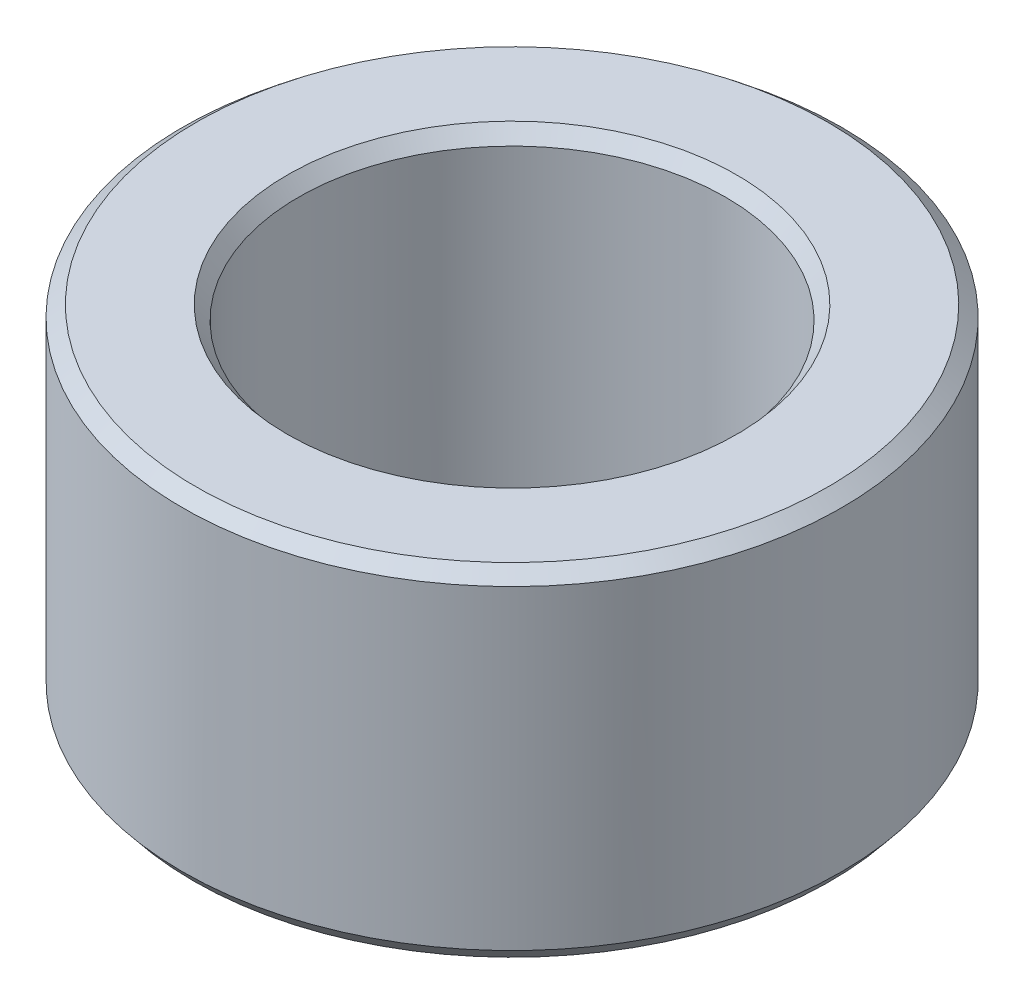
ISO-10303-21;
HEADER;
FILE_DESCRIPTION(('STEP AP214'),'2;1');
FILE_NAME('part.step','',(''),(''),'','','');
FILE_SCHEMA(('AUTOMOTIVE_DESIGN { 1 0 10303 214 1 1 1 1 }'));
ENDSEC;
DATA;
#1=APPLICATION_CONTEXT('core data for automotive mechanical design processes');
#2=APPLICATION_PROTOCOL_DEFINITION('international standard','automotive_design',2000,#1);
#3=PRODUCT_CONTEXT('',#1,'mechanical');
#4=PRODUCT('Part','Part','',(#3));
#5=PRODUCT_RELATED_PRODUCT_CATEGORY('part','',(#4));
#6=PRODUCT_DEFINITION_FORMATION('','',#4);
#7=PRODUCT_DEFINITION_CONTEXT('part definition',#1,'design');
#8=PRODUCT_DEFINITION('design','',#6,#7);
#9=PRODUCT_DEFINITION_SHAPE('','',#8);
#10=(LENGTH_UNIT() NAMED_UNIT(*) SI_UNIT(.MILLI.,.METRE.));
#11=(NAMED_UNIT(*) PLANE_ANGLE_UNIT() SI_UNIT($,.RADIAN.));
#12=(NAMED_UNIT(*) SI_UNIT($,.STERADIAN.) SOLID_ANGLE_UNIT());
#13=UNCERTAINTY_MEASURE_WITH_UNIT(LENGTH_MEASURE(1.E-05),#10,'distance_accuracy_value','');
#14=(GEOMETRIC_REPRESENTATION_CONTEXT(3) GLOBAL_UNCERTAINTY_ASSIGNED_CONTEXT((#13)) GLOBAL_UNIT_ASSIGNED_CONTEXT((#10,
#11,#12)) REPRESENTATION_CONTEXT('',''));
#15=CARTESIAN_POINT('',(0.,0.,0.));
#16=DIRECTION('',(0.,0.,1.));
#17=DIRECTION('',(1.,0.,0.));
#18=AXIS2_PLACEMENT_3D('',#15,#16,#17);
#19=CARTESIAN_POINT('',(0.,59.3305391658397,0.));
#20=DIRECTION('',(0.,-1.,0.));
#21=DIRECTION('',(0.,0.,-1.));
#22=AXIS2_PLACEMENT_3D('',#19,#20,#21);
#23=CYLINDRICAL_SURFACE('',#22,57.5);
#24=CARTESIAN_POINT('',(0.,2.39004731838705,0.));
#25=DIRECTION('',(0.,1.,0.));
#26=DIRECTION('',(0.,0.,1.));
#27=AXIS2_PLACEMENT_3D('',#24,#25,#26);
#28=CIRCLE('',#27,57.5);
#29=CARTESIAN_POINT('',(0.,2.39004731838704,-57.5));
#30=VERTEX_POINT('',#29);
#31=EDGE_CURVE('E10',#30,#30,#28,.T.);
#32=CARTESIAN_POINT('',(0.,57.3840352980018,0.));
#33=DIRECTION('',(0.,1.,0.));
#34=DIRECTION('',(0.,0.,1.));
#35=AXIS2_PLACEMENT_3D('',#32,#33,#34);
#36=CIRCLE('',#35,57.5);
#37=CARTESIAN_POINT('',(0.,57.3840352980018,-57.5));
#38=VERTEX_POINT('',#37);
#39=EDGE_CURVE('E50',#38,#38,#36,.F.);
#40=CARTESIAN_POINT('',(0.,2.39004731838704,-57.5));
#41=CARTESIAN_POINT('',(0.,2.96290135984136,-57.5));
#42=CARTESIAN_POINT('',(0.,3.53575540129568,-57.5));
#43=CARTESIAN_POINT('',(0.,4.68146348420432,-57.5));
#44=CARTESIAN_POINT('',(0.,5.25431752565865,-57.5));
#45=CARTESIAN_POINT('',(0.,6.40002560856729,-57.5));
#46=CARTESIAN_POINT('',(0.,6.9728796500216,-57.5));
#47=CARTESIAN_POINT('',(0.,8.11858773293025,-57.5));
#48=CARTESIAN_POINT('',(0.,8.69144177438457,-57.5));
#49=CARTESIAN_POINT('',(0.,9.83714985729321,-57.5));
#50=CARTESIAN_POINT('',(0.,10.4100038987475,-57.5));
#51=CARTESIAN_POINT('',(0.,11.5557119816562,-57.5));
#52=CARTESIAN_POINT('',(0.,12.1285660231105,-57.5));
#53=CARTESIAN_POINT('',(0.,13.2742741060191,-57.5));
#54=CARTESIAN_POINT('',(0.,13.8471281474735,-57.5));
#55=CARTESIAN_POINT('',(0.,14.9928362303821,-57.5));
#56=CARTESIAN_POINT('',(0.,15.5656902718364,-57.5));
#57=CARTESIAN_POINT('',(0.,16.7113983547451,-57.5));
#58=CARTESIAN_POINT('',(0.,17.2842523961994,-57.5));
#59=CARTESIAN_POINT('',(0.,18.429960479108,-57.5));
#60=CARTESIAN_POINT('',(0.,19.0028145205623,-57.5));
#61=CARTESIAN_POINT('',(0.,20.148522603471,-57.5));
#62=CARTESIAN_POINT('',(0.,20.7213766449253,-57.5));
#63=CARTESIAN_POINT('',(0.,21.8670847278339,-57.5));
#64=CARTESIAN_POINT('',(0.,22.4399387692883,-57.5));
#65=CARTESIAN_POINT('',(0.,23.5856468521969,-57.5));
#66=CARTESIAN_POINT('',(0.,24.1585008936512,-57.5));
#67=CARTESIAN_POINT('',(0.,25.3042089765599,-57.5));
#68=CARTESIAN_POINT('',(0.,25.8770630180142,-57.5));
#69=CARTESIAN_POINT('',(0.,27.0227711009228,-57.5));
#70=CARTESIAN_POINT('',(0.,27.5956251423772,-57.5));
#71=CARTESIAN_POINT('',(0.,28.7413332252858,-57.5));
#72=CARTESIAN_POINT('',(0.,29.3141872667401,-57.5));
#73=CARTESIAN_POINT('',(0.,30.4598953496488,-57.5));
#74=CARTESIAN_POINT('',(0.,31.0327493911031,-57.5));
#75=CARTESIAN_POINT('',(0.,32.1784574740117,-57.5));
#76=CARTESIAN_POINT('',(0.,32.751311515466,-57.5));
#77=CARTESIAN_POINT('',(0.,33.8970195983747,-57.5));
#78=CARTESIAN_POINT('',(0.,34.469873639829,-57.5));
#79=CARTESIAN_POINT('',(0.,35.6155817227376,-57.5));
#80=CARTESIAN_POINT('',(0.,36.188435764192,-57.5));
#81=CARTESIAN_POINT('',(0.,37.3341438471006,-57.5));
#82=CARTESIAN_POINT('',(0.,37.9069978885549,-57.5));
#83=CARTESIAN_POINT('',(0.,39.0527059714636,-57.5));
#84=CARTESIAN_POINT('',(0.,39.6255600129179,-57.5));
#85=CARTESIAN_POINT('',(0.,40.7712680958265,-57.5));
#86=CARTESIAN_POINT('',(0.,41.3441221372808,-57.5));
#87=CARTESIAN_POINT('',(0.,42.4898302201895,-57.5));
#88=CARTESIAN_POINT('',(0.,43.0626842616438,-57.5));
#89=CARTESIAN_POINT('',(0.,44.2083923445525,-57.5));
#90=CARTESIAN_POINT('',(0.,44.7812463860068,-57.5));
#91=CARTESIAN_POINT('',(0.,45.9269544689154,-57.5));
#92=CARTESIAN_POINT('',(0.,46.4998085103697,-57.5));
#93=CARTESIAN_POINT('',(0.,47.6455165932784,-57.5));
#94=CARTESIAN_POINT('',(0.,48.2183706347327,-57.5));
#95=CARTESIAN_POINT('',(0.,49.3640787176413,-57.5));
#96=CARTESIAN_POINT('',(0.,49.9369327590957,-57.5));
#97=CARTESIAN_POINT('',(0.,51.0826408420043,-57.5));
#98=CARTESIAN_POINT('',(0.,51.6554948834586,-57.5));
#99=CARTESIAN_POINT('',(0.,52.8012029663673,-57.5));
#100=CARTESIAN_POINT('',(0.,53.3740570078216,-57.5));
#101=CARTESIAN_POINT('',(0.,54.5197650907302,-57.5));
#102=CARTESIAN_POINT('',(0.,55.0926191321845,-57.5));
#103=CARTESIAN_POINT('',(0.,56.2383272150932,-57.5));
#104=CARTESIAN_POINT('',(0.,56.8111812565475,-57.5));
#105=CARTESIAN_POINT('',(0.,57.3840352980018,-57.5));
#106=B_SPLINE_CURVE_WITH_KNOTS('',3,(#40,#41,#42,#43,#44,#45,#46,#47,#48,#49,#50,#51,#52,#53,
#54,#55,#56,#57,#58,#59,#60,#61,#62,#63,#64,#65,#66,#67,#68,#69,#70,#71,#72,#73,#74,#75,#76,#77,
#78,#79,#80,#81,#82,#83,#84,#85,#86,#87,#88,#89,#90,#91,#92,#93,#94,#95,#96,#97,#98,#99,#100,
#101,#102,#103,#104,#105),.UNSPECIFIED.,.F.,.F.,(4,2,2,2,2,2,2,2,2,2,2,2,2,2,2,2,2,2,2,2,2,2,2,
2,2,2,2,2,2,2,2,2,4),(0.,1.71856212436296,3.43712424872593,5.15568637308889,6.87424849745185,
8.59281062181481,10.3113727461778,12.0299348705407,13.7484969949037,15.4670591192667,
17.1856212436296,18.9041833679926,20.6227454923555,22.3413076167185,24.0598697410815,
25.7784318654444,27.4969939898074,29.2155561141704,30.9341182385333,32.6526803628963,
34.3712424872593,36.0898046116222,37.8083667359852,39.5269288603481,41.2454909847111,
42.9640531090741,44.682615233437,46.4011773578,48.1197394821629,49.8383016065259,
51.5568637308889,53.2754258552518,54.9939879796148),.UNSPECIFIED.);
#107=EDGE_CURVE('BSEAM39',#30,#38,#106,.T.);
#108=ORIENTED_EDGE('',*,*,#31,.T.);
#109=ORIENTED_EDGE('',*,*,#39,.T.);
#110=ORIENTED_EDGE('',*,*,#107,.T.);
#111=ORIENTED_EDGE('',*,*,#107,.F.);
#112=EDGE_LOOP('',(#108,#110,#109,#111));
#113=FACE_BOUND('',#112,.T.);
#114=ADVANCED_FACE('F39',(#113),#23,.T.);
#115=CARTESIAN_POINT('',(0.,59.3305391658397,0.));
#116=DIRECTION('',(0.,1.,0.));
#117=DIRECTION('',(0.,0.,1.));
#118=AXIS2_PLACEMENT_3D('',#115,#116,#117);
#119=PLANE('',#118);
#120=CARTESIAN_POINT('',(0.,59.3305391658397,0.));
#121=DIRECTION('',(0.,1.,0.));
#122=DIRECTION('',(0.,0.,1.));
#123=AXIS2_PLACEMENT_3D('',#120,#121,#122);
#124=CIRCLE('',#123,39.2100490284824);
#125=CARTESIAN_POINT('',(0.,59.3305391658397,39.2100490284824));
#126=VERTEX_POINT('',#125);
#127=EDGE_CURVE('E58',#126,#126,#124,.F.);
#128=ORIENTED_EDGE('',*,*,#127,.T.);
#129=EDGE_LOOP('',(#128));
#130=FACE_BOUND('',#129,.T.);
#131=CARTESIAN_POINT('',(0.,59.3305391658397,0.));
#132=DIRECTION('',(0.,1.,0.));
#133=DIRECTION('',(0.,0.,1.));
#134=AXIS2_PLACEMENT_3D('',#131,#132,#133);
#135=CIRCLE('',#134,55.1099526816131);
#136=CARTESIAN_POINT('',(0.,59.3305391658397,-55.1099526816131));
#137=VERTEX_POINT('',#136);
#138=EDGE_CURVE('E61',#137,#137,#135,.T.);
#139=ORIENTED_EDGE('',*,*,#138,.T.);
#140=EDGE_LOOP('',(#139));
#141=FACE_BOUND('',#140,.T.);
#142=ADVANCED_FACE('F88',(#130,#141),#119,.T.);
#143=CARTESIAN_POINT('',(0.,0.,0.));
#144=DIRECTION('',(0.,1.,0.));
#145=DIRECTION('',(0.,0.,1.));
#146=AXIS2_PLACEMENT_3D('',#143,#144,#145);
#147=PLANE('',#146);
#148=CARTESIAN_POINT('',(0.,0.,0.));
#149=DIRECTION('',(0.,1.,0.));
#150=DIRECTION('',(0.,0.,1.));
#151=AXIS2_PLACEMENT_3D('',#148,#149,#150);
#152=CIRCLE('',#151,39.6535924790313);
#153=CARTESIAN_POINT('',(0.,0.,39.6535924790313));
#154=VERTEX_POINT('',#153);
#155=EDGE_CURVE('E51',#154,#154,#152,.T.);
#156=ORIENTED_EDGE('',*,*,#155,.T.);
#157=EDGE_LOOP('',(#156));
#158=FACE_BOUND('',#157,.T.);
#159=CARTESIAN_POINT('',(0.,0.,0.));
#160=DIRECTION('',(0.,1.,0.));
#161=DIRECTION('',(0.,0.,1.));
#162=AXIS2_PLACEMENT_3D('',#159,#160,#161);
#163=CIRCLE('',#162,55.553496132162);
#164=CARTESIAN_POINT('',(0.,0.,55.553496132162));
#165=VERTEX_POINT('',#164);
#166=EDGE_CURVE('E54',#165,#165,#163,.F.);
#167=ORIENTED_EDGE('',*,*,#166,.T.);
#168=EDGE_LOOP('',(#167));
#169=FACE_BOUND('',#168,.T.);
#170=ADVANCED_FACE('F83',(#158,#169),#147,.F.);
#171=CARTESIAN_POINT('',(0.,59.3305391658397,0.));
#172=DIRECTION('',(0.,-1.,0.));
#173=DIRECTION('',(0.,0.,-1.));
#174=AXIS2_PLACEMENT_3D('',#171,#172,#173);
#175=CYLINDRICAL_SURFACE('',#174,37.2635451606444);
#176=CARTESIAN_POINT('',(0.,56.9404918474526,0.));
#177=DIRECTION('',(0.,1.,0.));
#178=DIRECTION('',(0.,0.,1.));
#179=AXIS2_PLACEMENT_3D('',#176,#177,#178);
#180=CIRCLE('',#179,37.2635451606444);
#181=CARTESIAN_POINT('',(0.,56.9404918474526,-37.2635451606444));
#182=VERTEX_POINT('',#181);
#183=EDGE_CURVE('E67',#182,#182,#180,.T.);
#184=CARTESIAN_POINT('',(0.,1.94650386783791,0.));
#185=DIRECTION('',(0.,1.,0.));
#186=DIRECTION('',(0.,0.,1.));
#187=AXIS2_PLACEMENT_3D('',#184,#185,#186);
#188=CIRCLE('',#187,37.2635451606444);
#189=CARTESIAN_POINT('',(0.,1.94650386783791,-37.2635451606444));
#190=VERTEX_POINT('',#189);
#191=EDGE_CURVE('E69',#190,#190,#188,.F.);
#192=CARTESIAN_POINT('',(0.,56.9404918474526,-37.2635451606444));
#193=CARTESIAN_POINT('',(0.,56.3676378059983,-37.2635451606444));
#194=CARTESIAN_POINT('',(0.,55.794783764544,-37.2635451606444));
#195=CARTESIAN_POINT('',(0.,54.6490756816353,-37.2635451606444));
#196=CARTESIAN_POINT('',(0.,54.076221640181,-37.2635451606444));
#197=CARTESIAN_POINT('',(0.,52.9305135572724,-37.2635451606444));
#198=CARTESIAN_POINT('',(0.,52.357659515818,-37.2635451606444));
#199=CARTESIAN_POINT('',(0.,51.2119514329094,-37.2635451606444));
#200=CARTESIAN_POINT('',(0.,50.6390973914551,-37.2635451606444));
#201=CARTESIAN_POINT('',(0.,49.4933893085464,-37.2635451606444));
#202=CARTESIAN_POINT('',(0.,48.9205352670921,-37.2635451606444));
#203=CARTESIAN_POINT('',(0.,47.7748271841835,-37.2635451606444));
#204=CARTESIAN_POINT('',(0.,47.2019731427292,-37.2635451606444));
#205=CARTESIAN_POINT('',(0.,46.0562650598205,-37.2635451606444));
#206=CARTESIAN_POINT('',(0.,45.4834110183662,-37.2635451606444));
#207=CARTESIAN_POINT('',(0.,44.3377029354576,-37.2635451606444));
#208=CARTESIAN_POINT('',(0.,43.7648488940033,-37.2635451606444));
#209=CARTESIAN_POINT('',(0.,42.6191408110946,-37.2635451606444));
#210=CARTESIAN_POINT('',(0.,42.0462867696403,-37.2635451606444));
#211=CARTESIAN_POINT('',(0.,40.9005786867316,-37.2635451606444));
#212=CARTESIAN_POINT('',(0.,40.3277246452773,-37.2635451606444));
#213=CARTESIAN_POINT('',(0.,39.1820165623687,-37.2635451606444));
#214=CARTESIAN_POINT('',(0.,38.6091625209144,-37.2635451606444));
#215=CARTESIAN_POINT('',(0.,37.4634544380057,-37.2635451606444));
#216=CARTESIAN_POINT('',(0.,36.8906003965514,-37.2635451606444));
#217=CARTESIAN_POINT('',(0.,35.7448923136428,-37.2635451606444));
#218=CARTESIAN_POINT('',(0.,35.1720382721884,-37.2635451606444));
#219=CARTESIAN_POINT('',(0.,34.0263301892798,-37.2635451606444));
#220=CARTESIAN_POINT('',(0.,33.4534761478255,-37.2635451606444));
#221=CARTESIAN_POINT('',(0.,32.3077680649169,-37.2635451606444));
#222=CARTESIAN_POINT('',(0.,31.7349140234625,-37.2635451606444));
#223=CARTESIAN_POINT('',(0.,30.5892059405539,-37.2635451606444));
#224=CARTESIAN_POINT('',(0.,30.0163518990996,-37.2635451606444));
#225=CARTESIAN_POINT('',(0.,28.8706438161909,-37.2635451606444));
#226=CARTESIAN_POINT('',(0.,28.2977897747366,-37.2635451606444));
#227=CARTESIAN_POINT('',(0.,27.152081691828,-37.2635451606444));
#228=CARTESIAN_POINT('',(0.,26.5792276503737,-37.2635451606444));
#229=CARTESIAN_POINT('',(0.,25.433519567465,-37.2635451606444));
#230=CARTESIAN_POINT('',(0.,24.8606655260107,-37.2635451606444));
#231=CARTESIAN_POINT('',(0.,23.7149574431021,-37.2635451606444));
#232=CARTESIAN_POINT('',(0.,23.1421034016477,-37.2635451606444));
#233=CARTESIAN_POINT('',(0.,21.9963953187391,-37.2635451606444));
#234=CARTESIAN_POINT('',(0.,21.4235412772848,-37.2635451606444));
#235=CARTESIAN_POINT('',(0.,20.2778331943761,-37.2635451606444));
#236=CARTESIAN_POINT('',(0.,19.7049791529218,-37.2635451606444));
#237=CARTESIAN_POINT('',(0.,18.5592710700132,-37.2635451606444));
#238=CARTESIAN_POINT('',(0.,17.9864170285589,-37.2635451606444));
#239=CARTESIAN_POINT('',(0.,16.8407089456502,-37.2635451606444));
#240=CARTESIAN_POINT('',(0.,16.2678549041959,-37.2635451606444));
#241=CARTESIAN_POINT('',(0.,15.1221468212873,-37.2635451606444));
#242=CARTESIAN_POINT('',(0.,14.5492927798329,-37.2635451606444));
#243=CARTESIAN_POINT('',(0.,13.4035846969243,-37.2635451606444));
#244=CARTESIAN_POINT('',(0.,12.83073065547,-37.2635451606444));
#245=CARTESIAN_POINT('',(0.,11.6850225725613,-37.2635451606444));
#246=CARTESIAN_POINT('',(0.,11.112168531107,-37.2635451606444));
#247=CARTESIAN_POINT('',(0.,9.96646044819838,-37.2635451606444));
#248=CARTESIAN_POINT('',(0.,9.39360640674406,-37.2635451606444));
#249=CARTESIAN_POINT('',(0.,8.24789832383543,-37.2635451606444));
#250=CARTESIAN_POINT('',(0.,7.67504428238111,-37.2635451606444));
#251=CARTESIAN_POINT('',(0.,6.52933619947247,-37.2635451606444));
#252=CARTESIAN_POINT('',(0.,5.95648215801815,-37.2635451606444));
#253=CARTESIAN_POINT('',(0.,4.81077407510951,-37.2635451606444));
#254=CARTESIAN_POINT('',(0.,4.23792003365519,-37.2635451606444));
#255=CARTESIAN_POINT('',(0.,3.09221195074655,-37.2635451606444));
#256=CARTESIAN_POINT('',(0.,2.51935790929223,-37.2635451606444));
#257=CARTESIAN_POINT('',(0.,1.94650386783791,-37.2635451606444));
#258=B_SPLINE_CURVE_WITH_KNOTS('',3,(#192,#193,#194,#195,#196,#197,#198,#199,#200,#201,#202,
#203,#204,#205,#206,#207,#208,#209,#210,#211,#212,#213,#214,#215,#216,#217,#218,#219,#220,#221,
#222,#223,#224,#225,#226,#227,#228,#229,#230,#231,#232,#233,#234,#235,#236,#237,#238,#239,#240,
#241,#242,#243,#244,#245,#246,#247,#248,#249,#250,#251,#252,#253,#254,#255,#256,#257),
.UNSPECIFIED.,.F.,.F.,(4,2,2,2,2,2,2,2,2,2,2,2,2,2,2,2,2,2,2,2,2,2,2,2,2,2,2,2,2,2,2,2,4),(0.,
1.71856212436296,3.43712424872591,5.15568637308887,6.87424849745184,8.59281062181479,
10.3113727461778,12.0299348705407,13.7484969949037,15.4670591192666,17.1856212436296,
18.9041833679925,20.6227454923555,22.3413076167185,24.0598697410814,25.7784318654444,
27.4969939898073,29.2155561141703,30.9341182385333,32.6526803628962,34.3712424872592,
36.0898046116221,37.8083667359851,39.5269288603481,41.245490984711,42.964053109074,
44.6826152334369,46.4011773577999,48.1197394821629,49.8383016065258,51.5568637308888,
53.2754258552517,54.9939879796147),.UNSPECIFIED.);
#259=EDGE_CURVE('BSEAM71',#182,#190,#258,.T.);
#260=ORIENTED_EDGE('',*,*,#183,.T.);
#261=ORIENTED_EDGE('',*,*,#191,.T.);
#262=ORIENTED_EDGE('',*,*,#259,.T.);
#263=ORIENTED_EDGE('',*,*,#259,.F.);
#264=EDGE_LOOP('',(#260,#262,#261,#263));
#265=FACE_BOUND('',#264,.T.);
#266=ADVANCED_FACE('F71',(#265),#175,.F.);
#267=CARTESIAN_POINT('',(0.,56.9404918474526,0.));
#268=DIRECTION('',(0.,1.,0.));
#269=DIRECTION('',(0.,0.,1.));
#270=AXIS2_PLACEMENT_3D('',#267,#268,#269);
#271=CONICAL_SURFACE('',#270,37.2635451606444,0.683472371357554);
#272=ORIENTED_EDGE('',*,*,#127,.F.);
#273=EDGE_LOOP('',(#272));
#274=FACE_BOUND('',#273,.T.);
#275=ORIENTED_EDGE('',*,*,#183,.F.);
#276=EDGE_LOOP('',(#275));
#277=FACE_BOUND('',#276,.T.);
#278=ADVANCED_FACE('F77',(#274,#277),#271,.F.);
#279=CARTESIAN_POINT('',(0.,0.,0.));
#280=DIRECTION('',(0.,-1.,0.));
#281=DIRECTION('',(0.,0.,-1.));
#282=AXIS2_PLACEMENT_3D('',#279,#280,#281);
#283=CONICAL_SURFACE('',#282,39.6535924790313,0.887323955437343);
#284=ORIENTED_EDGE('',*,*,#191,.F.);
#285=EDGE_LOOP('',(#284));
#286=FACE_BOUND('',#285,.T.);
#287=ORIENTED_EDGE('',*,*,#155,.F.);
#288=EDGE_LOOP('',(#287));
#289=FACE_BOUND('',#288,.T.);
#290=ADVANCED_FACE('F73',(#286,#289),#283,.F.);
#291=CARTESIAN_POINT('',(0.,2.39004731838705,0.));
#292=DIRECTION('',(0.,1.,0.));
#293=DIRECTION('',(0.,0.,1.));
#294=AXIS2_PLACEMENT_3D('',#291,#292,#293);
#295=CONICAL_SURFACE('',#294,57.5,0.683472371357561);
#296=ORIENTED_EDGE('',*,*,#166,.F.);
#297=EDGE_LOOP('',(#296));
#298=FACE_BOUND('',#297,.T.);
#299=ORIENTED_EDGE('',*,*,#31,.F.);
#300=EDGE_LOOP('',(#299));
#301=FACE_BOUND('',#300,.T.);
#302=ADVANCED_FACE('F76',(#298,#301),#295,.T.);
#303=CARTESIAN_POINT('',(0.,59.3305391658397,0.));
#304=DIRECTION('',(0.,-1.,0.));
#305=DIRECTION('',(0.,0.,-1.));
#306=AXIS2_PLACEMENT_3D('',#303,#304,#305);
#307=CONICAL_SURFACE('',#306,55.1099526816131,0.887323955437347);
#308=CARTESIAN_POINT('',(0.,57.3840352980018,-57.5));
#309=CARTESIAN_POINT('',(0.,57.4043113799585,-57.4751036737668));
#310=CARTESIAN_POINT('',(0.,57.4245874619151,-57.4502073475336));
#311=CARTESIAN_POINT('',(0.,57.4651396258284,-57.4004146950672));
#312=CARTESIAN_POINT('',(0.,57.4854157077851,-57.375518368834));
#313=CARTESIAN_POINT('',(0.,57.5259678716983,-57.3257257163676));
#314=CARTESIAN_POINT('',(0.,57.546243953655,-57.3008293901344));
#315=CARTESIAN_POINT('',(0.,57.5867961175683,-57.251036737668));
#316=CARTESIAN_POINT('',(0.,57.6070721995249,-57.2261404114348));
#317=CARTESIAN_POINT('',(0.,57.6476243634382,-57.1763477589685));
#318=CARTESIAN_POINT('',(0.,57.6679004453949,-57.1514514327353));
#319=CARTESIAN_POINT('',(0.,57.7084526093081,-57.1016587802689));
#320=CARTESIAN_POINT('',(0.,57.7287286912648,-57.0767624540357));
#321=CARTESIAN_POINT('',(0.,57.7692808551781,-57.0269698015693));
#322=CARTESIAN_POINT('',(0.,57.7895569371347,-57.0020734753361));
#323=CARTESIAN_POINT('',(0.,57.830109101048,-56.9522808228697));
#324=CARTESIAN_POINT('',(0.,57.8503851830047,-56.9273844966365));
#325=CARTESIAN_POINT('',(0.,57.8909373469179,-56.8775918441701));
#326=CARTESIAN_POINT('',(0.,57.9112134288746,-56.8526955179369));
#327=CARTESIAN_POINT('',(0.,57.9517655927879,-56.8029028654705));
#328=CARTESIAN_POINT('',(0.,57.9720416747445,-56.7780065392373));
#329=CARTESIAN_POINT('',(0.,58.0125938386578,-56.7282138867709));
#330=CARTESIAN_POINT('',(0.,58.0328699206145,-56.7033175605377));
#331=CARTESIAN_POINT('',(0.,58.0734220845277,-56.6535249080713));
#332=CARTESIAN_POINT('',(0.,58.0936981664844,-56.6286285818381));
#333=CARTESIAN_POINT('',(0.,58.1342503303977,-56.5788359293717));
#334=CARTESIAN_POINT('',(0.,58.1545264123543,-56.5539396031385));
#335=CARTESIAN_POINT('',(0.,58.1950785762676,-56.5041469506721));
#336=CARTESIAN_POINT('',(0.,58.2153546582242,-56.4792506244389));
#337=CARTESIAN_POINT('',(0.,58.2559068221375,-56.4294579719725));
#338=CARTESIAN_POINT('',(0.,58.2761829040942,-56.4045616457393));
#339=CARTESIAN_POINT('',(0.,58.3167350680075,-56.354768993273));
#340=CARTESIAN_POINT('',(0.,58.3370111499641,-56.3298726670398));
#341=CARTESIAN_POINT('',(0.,58.3775633138774,-56.2800800145734));
#342=CARTESIAN_POINT('',(0.,58.3978393958341,-56.2551836883402));
#343=CARTESIAN_POINT('',(0.,58.4383915597473,-56.2053910358738));
#344=CARTESIAN_POINT('',(0.,58.458667641704,-56.1804947096406));
#345=CARTESIAN_POINT('',(0.,58.4992198056173,-56.1307020571742));
#346=CARTESIAN_POINT('',(0.,58.5194958875739,-56.105805730941));
#347=CARTESIAN_POINT('',(0.,58.5600480514872,-56.0560130784746));
#348=CARTESIAN_POINT('',(0.,58.5803241334439,-56.0311167522414));
#349=CARTESIAN_POINT('',(0.,58.6208762973571,-55.981324099775));
#350=CARTESIAN_POINT('',(0.,58.6411523793138,-55.9564277735418));
#351=CARTESIAN_POINT('',(0.,58.6817045432271,-55.9066351210754));
#352=CARTESIAN_POINT('',(0.,58.7019806251837,-55.8817387948422));
#353=CARTESIAN_POINT('',(0.,58.742532789097,-55.8319461423758));
#354=CARTESIAN_POINT('',(0.,58.7628088710536,-55.8070498161426));
#355=CARTESIAN_POINT('',(0.,58.8033610349669,-55.7572571636762));
#356=CARTESIAN_POINT('',(0.,58.8236371169236,-55.732360837443));
#357=CARTESIAN_POINT('',(0.,58.8641892808369,-55.6825681849766));
#358=CARTESIAN_POINT('',(0.,58.8844653627935,-55.6576718587434));
#359=CARTESIAN_POINT('',(0.,58.9250175267068,-55.6078792062771));
#360=CARTESIAN_POINT('',(0.,58.9452936086634,-55.5829828800439));
#361=CARTESIAN_POINT('',(0.,58.9858457725767,-55.5331902275775));
#362=CARTESIAN_POINT('',(0.,59.0061218545334,-55.5082939013443));
#363=CARTESIAN_POINT('',(0.,59.0466740184467,-55.4585012488779));
#364=CARTESIAN_POINT('',(0.,59.0669501004033,-55.4336049226447));
#365=CARTESIAN_POINT('',(0.,59.1075022643166,-55.3838122701783));
#366=CARTESIAN_POINT('',(0.,59.1277783462732,-55.3589159439451));
#367=CARTESIAN_POINT('',(0.,59.1683305101865,-55.3091232914787));
#368=CARTESIAN_POINT('',(0.,59.1886065921432,-55.2842269652455));
#369=CARTESIAN_POINT('',(0.,59.2291587560565,-55.2344343127791));
#370=CARTESIAN_POINT('',(0.,59.2494348380131,-55.2095379865459));
#371=CARTESIAN_POINT('',(0.,59.2899870019264,-55.1597453340795));
#372=CARTESIAN_POINT('',(0.,59.3102630838831,-55.1348490078463));
#373=CARTESIAN_POINT('',(0.,59.3305391658397,-55.1099526816131));
#374=B_SPLINE_CURVE_WITH_KNOTS('',3,(#308,#309,#310,#311,#312,#313,#314,#315,#316,#317,#318,
#319,#320,#321,#322,#323,#324,#325,#326,#327,#328,#329,#330,#331,#332,#333,#334,#335,#336,#337,
#338,#339,#340,#341,#342,#343,#344,#345,#346,#347,#348,#349,#350,#351,#352,#353,#354,#355,#356,
#357,#358,#359,#360,#361,#362,#363,#364,#365,#366,#367,#368,#369,#370,#371,#372,#373),
.UNSPECIFIED.,.F.,.F.,(4,2,2,2,2,2,2,2,2,2,2,2,2,2,2,2,2,2,2,2,2,2,2,2,2,2,2,2,2,2,2,2,4),(0.,
0.0963250696070351,0.192650139214075,0.288975208821114,0.385300278428153,0.481625348035194,
0.577950417642233,0.674275487249273,0.770600556856312,0.866925626463352,0.963250696070387,
1.05957576567743,1.15590083528447,1.25222590489151,1.34855097449854,1.44487604410558,
1.54120111371262,1.63752618331966,1.7338512529267,1.83017632253373,1.92650139214077,
2.02282646174781,2.11915153135485,2.21547660096189,2.31180167056893,2.40812674017597,
2.504451809783,2.60077687939004,2.69710194899708,2.79342701860412,2.88975208821116,
2.9860771578182,3.08240222742524),.UNSPECIFIED.);
#375=EDGE_CURVE('BSEAM45',#38,#137,#374,.T.);
#376=ORIENTED_EDGE('',*,*,#39,.F.);
#377=ORIENTED_EDGE('',*,*,#138,.F.);
#378=ORIENTED_EDGE('',*,*,#375,.T.);
#379=ORIENTED_EDGE('',*,*,#375,.F.);
#380=EDGE_LOOP('',(#376,#378,#377,#379));
#381=FACE_BOUND('',#380,.T.);
#382=ADVANCED_FACE('F45',(#381),#307,.T.);
#383=CLOSED_SHELL('',(#114,#142,#170,#266,#278,#290,#302,#382));
#384=MANIFOLD_SOLID_BREP('B2',#383);
#385=ADVANCED_BREP_SHAPE_REPRESENTATION('',(#18,#384),#14);
#386=SHAPE_DEFINITION_REPRESENTATION(#9,#385);
ENDSEC;
END-ISO-10303-21;
